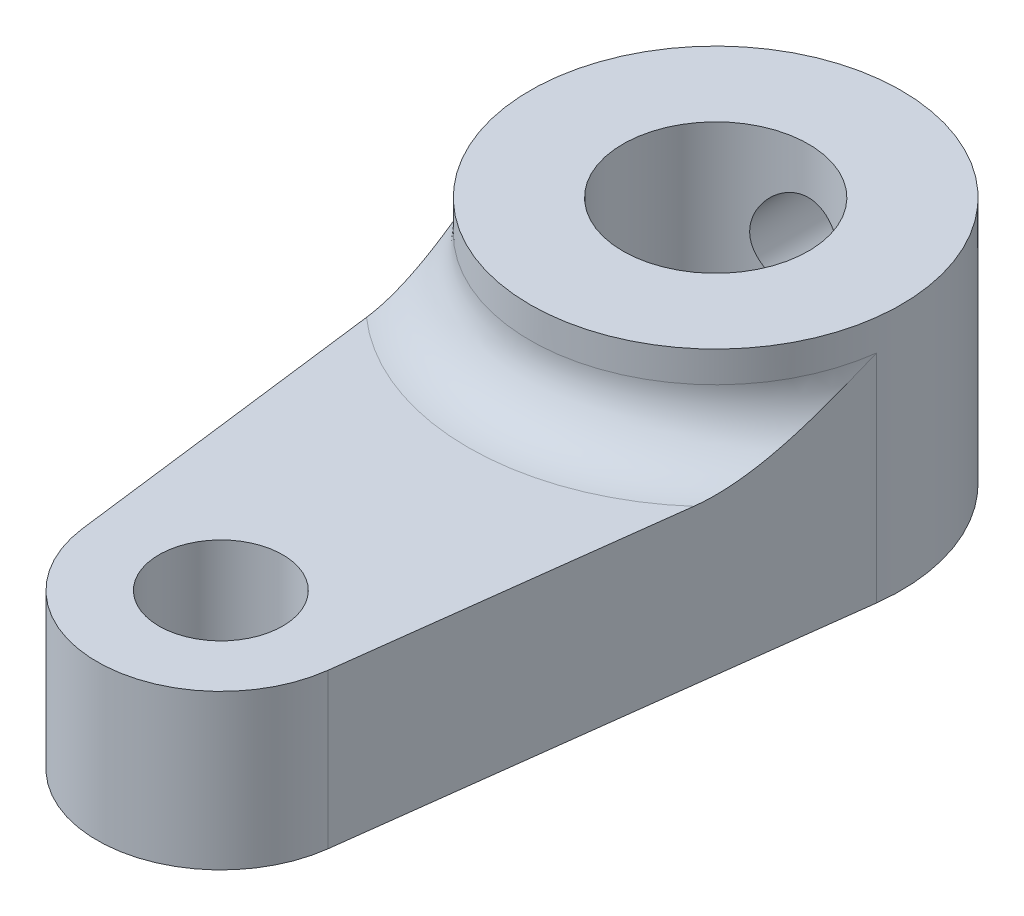
ISO-10303-21;
HEADER;
FILE_DESCRIPTION(('STEP AP214'),'2;1');
FILE_NAME('part.step','',(''),(''),'','','');
FILE_SCHEMA(('AUTOMOTIVE_DESIGN { 1 0 10303 214 1 1 1 1 }'));
ENDSEC;
DATA;
#1=APPLICATION_CONTEXT('core data for automotive mechanical design processes');
#2=APPLICATION_PROTOCOL_DEFINITION('international standard','automotive_design',2000,#1);
#3=PRODUCT_CONTEXT('',#1,'mechanical');
#4=PRODUCT('Part','Part','',(#3));
#5=PRODUCT_RELATED_PRODUCT_CATEGORY('part','',(#4));
#6=PRODUCT_DEFINITION_FORMATION('','',#4);
#7=PRODUCT_DEFINITION_CONTEXT('part definition',#1,'design');
#8=PRODUCT_DEFINITION('design','',#6,#7);
#9=PRODUCT_DEFINITION_SHAPE('','',#8);
#10=(LENGTH_UNIT() NAMED_UNIT(*) SI_UNIT(.MILLI.,.METRE.));
#11=(NAMED_UNIT(*) PLANE_ANGLE_UNIT() SI_UNIT($,.RADIAN.));
#12=(NAMED_UNIT(*) SI_UNIT($,.STERADIAN.) SOLID_ANGLE_UNIT());
#13=UNCERTAINTY_MEASURE_WITH_UNIT(LENGTH_MEASURE(1.E-05),#10,'distance_accuracy_value','');
#14=(GEOMETRIC_REPRESENTATION_CONTEXT(3) GLOBAL_UNCERTAINTY_ASSIGNED_CONTEXT((#13)) GLOBAL_UNIT_ASSIGNED_CONTEXT((#10,
#11,#12)) REPRESENTATION_CONTEXT('',''));
#15=CARTESIAN_POINT('',(0.,0.,0.));
#16=DIRECTION('',(0.,0.,1.));
#17=DIRECTION('',(1.,0.,0.));
#18=AXIS2_PLACEMENT_3D('',#15,#16,#17);
#19=CARTESIAN_POINT('',(-5.95294044989533,5.,0.750000000000001));
#20=DIRECTION('',(0.992156741649222,0.,-0.125));
#21=DIRECTION('',(-0.125,0.,-0.992156741649222));
#22=AXIS2_PLACEMENT_3D('',#19,#20,#21);
#23=PLANE('',#22);
#24=DIRECTION('',(0.125,0.,0.992156741649222));
#25=VECTOR('',#24,1.);
#26=CARTESIAN_POINT('',(-5.95294044989533,0.,0.750000000000001));
#27=LINE('',#26,#25);
#28=CARTESIAN_POINT('',(-5.95294044989533,0.,0.750000000000001));
#29=VERTEX_POINT('',#28);
#30=CARTESIAN_POINT('',(-3.96862696659688,0.,16.5));
#31=VERTEX_POINT('',#30);
#32=EDGE_CURVE('E168',#29,#31,#27,.T.);
#33=ORIENTED_EDGE('',*,*,#32,.T.);
#34=DIRECTION('',(0.,-1.,0.));
#35=VECTOR('',#34,1.);
#36=CARTESIAN_POINT('',(-3.96862696659688,5.,16.5));
#37=LINE('',#36,#35);
#38=CARTESIAN_POINT('',(-3.96862696659688,5.,16.5));
#39=VERTEX_POINT('',#38);
#40=EDGE_CURVE('E161',#39,#31,#37,.T.);
#41=ORIENTED_EDGE('',*,*,#40,.F.);
#42=DIRECTION('',(0.125,0.,0.992156741649222));
#43=VECTOR('',#42,1.);
#44=CARTESIAN_POINT('',(-5.95294044989533,5.,0.750000000000001));
#45=LINE('',#44,#43);
#46=CARTESIAN_POINT('',(-5.29150262212918,5.,6.00000000000001));
#47=VERTEX_POINT('',#46);
#48=EDGE_CURVE('E146',#47,#39,#45,.T.);
#49=ORIENTED_EDGE('',*,*,#48,.F.);
#50=CARTESIAN_POINT('',(-5.29150262212918,5.,6.));
#51=CARTESIAN_POINT('',(-5.31039781985104,5.00003932371851,5.85002401756371));
#52=CARTESIAN_POINT('',(-5.32927068108457,5.00749080861607,5.70022532550723));
#53=CARTESIAN_POINT('',(-5.3668298397168,5.03529748814452,5.40210874592607));
#54=CARTESIAN_POINT('',(-5.38551644968376,5.05562506504888,5.25378837746783));
#55=CARTESIAN_POINT('',(-5.42237695613113,5.10690972129888,4.96121717768887));
#56=CARTESIAN_POINT('',(-5.44055436264548,5.13771036698757,4.81693848633762));
#57=CARTESIAN_POINT('',(-5.47663555915596,5.20848018103613,4.53055286742049));
#58=CARTESIAN_POINT('',(-5.49453918362415,5.24845467894681,4.38844725369187));
#59=CARTESIAN_POINT('',(-5.55104862359349,5.38804779430905,3.93991747903271));
#60=CARTESIAN_POINT('',(-5.58909054596898,5.50228369716573,3.63796908103157));
#61=CARTESIAN_POINT('',(-5.66384180156036,5.75580816906752,3.04464938357773));
#62=CARTESIAN_POINT('',(-5.70054954085287,5.89512559194067,2.75329073549964));
#63=CARTESIAN_POINT('',(-5.80963672037306,6.33812108028194,1.88743809079183));
#64=CARTESIAN_POINT('',(-5.88048240155207,6.6653306727669,1.32511792920347));
#65=CARTESIAN_POINT('',(-5.95182241893323,6.99483605454595,0.758874095651361));
#66=CARTESIAN_POINT('',(-5.95238143594605,6.99741804396554,0.754437035667611));
#67=CARTESIAN_POINT('',(-5.95294044989533,7.,0.750000000000001));
#68=B_SPLINE_CURVE_WITH_KNOTS('',3,(#50,#51,#52,#53,#54,#55,#56,#57,#58,#59,#60,#61,#62,#63,#64,
#65,#66,#67),.UNSPECIFIED.,.F.,.F.,(4,2,2,2,2,2,2,2,4),(0.,0.453047985174652,0.905127510169083,
1.35073120961699,1.79659444088085,2.76988627914147,3.74430503334612,5.70583133706968,
5.72132327058451),.UNSPECIFIED.);
#69=CARTESIAN_POINT('',(-5.95294044989533,7.,0.750000000000001));
#70=VERTEX_POINT('',#69);
#71=EDGE_CURVE('E50',#47,#70,#68,.T.);
#72=ORIENTED_EDGE('',*,*,#71,.T.);
#73=DIRECTION('',(0.,-1.,0.));
#74=VECTOR('',#73,1.);
#75=CARTESIAN_POINT('',(-5.95294044989533,5.,0.750000000000001));
#76=LINE('',#75,#74);
#77=EDGE_CURVE('E337',#70,#29,#76,.T.);
#78=ORIENTED_EDGE('',*,*,#77,.T.);
#79=EDGE_LOOP('',(#33,#41,#49,#72,#78));
#80=FACE_BOUND('',#79,.T.);
#81=ADVANCED_FACE('F95',(#80),#23,.F.);
#82=CARTESIAN_POINT('',(0.,5.,16.));
#83=DIRECTION('',(0.,-1.,0.));
#84=DIRECTION('',(0.,0.,-1.));
#85=AXIS2_PLACEMENT_3D('',#82,#83,#84);
#86=CYLINDRICAL_SURFACE('',#85,4.);
#87=CARTESIAN_POINT('',(0.,0.,16.));
#88=DIRECTION('',(0.,1.,0.));
#89=DIRECTION('',(0.,0.,1.));
#90=AXIS2_PLACEMENT_3D('',#87,#88,#89);
#91=CIRCLE('',#90,4.);
#92=CARTESIAN_POINT('',(3.96862696659689,0.,16.5));
#93=VERTEX_POINT('',#92);
#94=EDGE_CURVE('E339',#31,#93,#91,.T.);
#95=ORIENTED_EDGE('',*,*,#94,.T.);
#96=DIRECTION('',(0.,-1.,0.));
#97=VECTOR('',#96,1.);
#98=CARTESIAN_POINT('',(3.96862696659689,5.,16.5));
#99=LINE('',#98,#97);
#100=CARTESIAN_POINT('',(3.96862696659689,5.,16.5));
#101=VERTEX_POINT('',#100);
#102=EDGE_CURVE('E163',#101,#93,#99,.T.);
#103=ORIENTED_EDGE('',*,*,#102,.F.);
#104=CARTESIAN_POINT('',(0.,5.,16.));
#105=DIRECTION('',(0.,1.,0.));
#106=DIRECTION('',(0.,0.,1.));
#107=AXIS2_PLACEMENT_3D('',#104,#105,#106);
#108=CIRCLE('',#107,4.);
#109=EDGE_CURVE('E150',#39,#101,#108,.T.);
#110=ORIENTED_EDGE('',*,*,#109,.F.);
#111=ORIENTED_EDGE('',*,*,#40,.T.);
#112=EDGE_LOOP('',(#95,#103,#110,#111));
#113=FACE_BOUND('',#112,.T.);
#114=ADVANCED_FACE('F160',(#113),#86,.T.);
#115=CARTESIAN_POINT('',(5.95294044989533,5.,0.75));
#116=DIRECTION('',(0.992156741649222,0.,0.125));
#117=DIRECTION('',(0.125,0.,-0.992156741649222));
#118=AXIS2_PLACEMENT_3D('',#115,#116,#117);
#119=PLANE('',#118);
#120=DIRECTION('',(-0.125,0.,0.992156741649222));
#121=VECTOR('',#120,1.);
#122=CARTESIAN_POINT('',(5.95294044989533,0.,0.75));
#123=LINE('',#122,#121);
#124=CARTESIAN_POINT('',(5.95294044989533,0.,0.749999999999999));
#125=VERTEX_POINT('',#124);
#126=EDGE_CURVE('E341',#125,#93,#123,.T.);
#127=ORIENTED_EDGE('',*,*,#126,.F.);
#128=DIRECTION('',(0.,-1.,0.));
#129=VECTOR('',#128,1.);
#130=CARTESIAN_POINT('',(5.95294044989533,5.,0.749999999999999));
#131=LINE('',#130,#129);
#132=CARTESIAN_POINT('',(5.95294044989533,7.,0.749999999999999));
#133=VERTEX_POINT('',#132);
#134=EDGE_CURVE('E173',#133,#125,#131,.T.);
#135=ORIENTED_EDGE('',*,*,#134,.F.);
#136=CARTESIAN_POINT('',(5.29150262212918,5.,6.));
#137=CARTESIAN_POINT('',(5.31039781985099,5.00003932371851,5.85002401756408));
#138=CARTESIAN_POINT('',(5.32927068108448,5.00749080861603,5.70022532550798));
#139=CARTESIAN_POINT('',(5.36682983971663,5.03529748814436,5.40210874592749));
#140=CARTESIAN_POINT('',(5.38551644968354,5.05562506504863,5.25378837746954));
#141=CARTESIAN_POINT('',(5.42237695613093,5.10690972129854,4.96121717769049));
#142=CARTESIAN_POINT('',(5.44055436264532,5.13771036698727,4.81693848633887));
#143=CARTESIAN_POINT('',(5.47663555915588,5.20848018103597,4.53055286742109));
#144=CARTESIAN_POINT('',(5.49453918362412,5.24845467894676,4.38844725369219));
#145=CARTESIAN_POINT('',(5.55104862359351,5.388047794309,3.93991747903255));
#146=CARTESIAN_POINT('',(5.58909054596904,5.50228369716535,3.6379690810311));
#147=CARTESIAN_POINT('',(5.6638418015604,5.75580816906824,3.0446493835774));
#148=CARTESIAN_POINT('',(5.70054954085285,5.89512559194285,2.75329073549978));
#149=CARTESIAN_POINT('',(5.80963672037343,6.33812108027884,1.88743809078903));
#150=CARTESIAN_POINT('',(5.88048240155358,6.66533067274761,1.32511792919187));
#151=CARTESIAN_POINT('',(5.95182241893326,6.99483605454567,0.75887409565114));
#152=CARTESIAN_POINT('',(5.95238143594606,6.9974180439654,0.7544370356675));
#153=CARTESIAN_POINT('',(5.95294044989533,7.,0.75));
#154=B_SPLINE_CURVE_WITH_KNOTS('',3,(#136,#137,#138,#139,#140,#141,#142,#143,#144,#145,#146,
#147,#148,#149,#150,#151,#152,#153),.UNSPECIFIED.,.F.,.F.,(4,2,2,2,2,2,2,2,4),(0.,
0.453047985173508,0.905127510167047,1.35073120961605,1.79659444088085,2.7698862791418,
3.74430503334741,5.70583133706976,5.72132327058452),.UNSPECIFIED.);
#155=CARTESIAN_POINT('',(5.29150262212918,5.,6.));
#156=VERTEX_POINT('',#155);
#157=EDGE_CURVE('E110',#133,#156,#154,.F.);
#158=ORIENTED_EDGE('',*,*,#157,.T.);
#159=DIRECTION('',(-0.125,0.,0.992156741649222));
#160=VECTOR('',#159,1.);
#161=CARTESIAN_POINT('',(5.95294044989533,5.,0.75));
#162=LINE('',#161,#160);
#163=EDGE_CURVE('E164',#156,#101,#162,.T.);
#164=ORIENTED_EDGE('',*,*,#163,.T.);
#165=ORIENTED_EDGE('',*,*,#102,.T.);
#166=EDGE_LOOP('',(#127,#135,#158,#164,#165));
#167=FACE_BOUND('',#166,.T.);
#168=ADVANCED_FACE('F187',(#167),#119,.T.);
#169=CARTESIAN_POINT('',(0.,5.,0.));
#170=DIRECTION('',(0.,-1.,0.));
#171=DIRECTION('',(0.,0.,-1.));
#172=AXIS2_PLACEMENT_3D('',#169,#170,#171);
#173=CYLINDRICAL_SURFACE('',#172,6.);
#174=CARTESIAN_POINT('',(0.,6.5,-6.));
#175=CARTESIAN_POINT('',(-0.082876088669731,6.49999767426184,-5.99999859868013));
#176=CARTESIAN_POINT('',(-0.165778157830763,6.49310844922621,-5.99826578131828));
#177=CARTESIAN_POINT('',(-0.329206323770532,6.46577484869299,-5.99152113829892));
#178=CARTESIAN_POINT('',(-0.409731046870739,6.44532279046215,-5.98650745419968));
#179=CARTESIAN_POINT('',(-0.566020872182576,6.39156074653791,-5.9737562633204));
#180=CARTESIAN_POINT('',(-0.641791563430002,6.35826620128472,-5.96602202842087));
#181=CARTESIAN_POINT('',(-0.786672131904425,6.27981860995517,-5.94865343807593));
#182=CARTESIAN_POINT('',(-0.855781784348758,6.23466516388106,-5.9390190185405));
#183=CARTESIAN_POINT('',(-0.986801927300918,6.13279921034579,-5.91867413591801));
#184=CARTESIAN_POINT('',(-1.04855569006107,6.07588842504082,-5.90794707148533));
#185=CARTESIAN_POINT('',(-1.1617489272033,5.95254779509108,-5.8867362011753));
#186=CARTESIAN_POINT('',(-1.21318723694913,5.8861168770535,-5.87625242288349));
#187=CARTESIAN_POINT('',(-1.30502654279903,5.74440477326256,-5.8565477569971));
#188=CARTESIAN_POINT('',(-1.34525221592536,5.6690067691896,-5.84734794470605));
#189=CARTESIAN_POINT('',(-1.41239690855053,5.51225158834164,-5.83149494812223));
#190=CARTESIAN_POINT('',(-1.43931805543933,5.43089536667424,-5.82484135672789));
#191=CARTESIAN_POINT('',(-1.47855483680429,5.26625650179752,-5.81500476717551));
#192=CARTESIAN_POINT('',(-1.49115226833334,5.1830451039502,-5.81175491075426));
#193=CARTESIAN_POINT('',(-1.50226177506785,5.01563143098602,-5.80889362537741));
#194=CARTESIAN_POINT('',(-1.50077614181798,4.93142931930139,-5.80928160448644));
#195=CARTESIAN_POINT('',(-1.48398652463928,4.76658419225552,-5.81359205496618));
#196=CARTESIAN_POINT('',(-1.46901834019052,4.6859043785349,-5.81742863001879));
#197=CARTESIAN_POINT('',(-1.4262241869031,4.52823894908871,-5.82806709676484));
#198=CARTESIAN_POINT('',(-1.39839730206942,4.45125359697102,-5.83486919970697));
#199=CARTESIAN_POINT('',(-1.33038947793715,4.30226198374793,-5.85075113904187));
#200=CARTESIAN_POINT('',(-1.29008666723291,4.23031382821045,-5.85985327469421));
#201=CARTESIAN_POINT('',(-1.19835627601495,4.09408129024316,-5.87929710846386));
#202=CARTESIAN_POINT('',(-1.14692674880884,4.02979825193274,-5.88963902334735));
#203=CARTESIAN_POINT('',(-1.03266342468122,3.9087963843056,-5.91075880539781));
#204=CARTESIAN_POINT('',(-0.969546258165858,3.85234550993865,-5.92154069477971));
#205=CARTESIAN_POINT('',(-0.834611917503699,3.7507787575361,-5.94205965578786));
#206=CARTESIAN_POINT('',(-0.762794477707943,3.70566322573644,-5.95179669549415));
#207=CARTESIAN_POINT('',(-0.612115888681391,3.62794941377562,-5.96917732094183));
#208=CARTESIAN_POINT('',(-0.533231393208623,3.59539465974557,-5.97681360127725));
#209=CARTESIAN_POINT('',(-0.370876008142882,3.54408269429043,-5.98907916991419));
#210=CARTESIAN_POINT('',(-0.287405999150484,3.52532284358186,-5.99370903339281));
#211=CARTESIAN_POINT('',(-0.120539970390027,3.50254243444116,-5.99935499271375));
#212=CARTESIAN_POINT('',(-0.0371967199882097,3.4981569739247,-6.00046053508279));
#213=CARTESIAN_POINT('',(0.129032874801508,3.50324900205549,-5.99918804814451));
#214=CARTESIAN_POINT('',(0.211919259644595,3.51272524279913,-5.99681033241847));
#215=CARTESIAN_POINT('',(0.373614268776491,3.54497090839138,-5.98889581127357));
#216=CARTESIAN_POINT('',(0.452465118968754,3.56754126347699,-5.98340634185811));
#217=CARTESIAN_POINT('',(0.605257292452511,3.62510708402845,-5.96988706634134));
#218=CARTESIAN_POINT('',(0.679198119032634,3.66010380431317,-5.96185700369892));
#219=CARTESIAN_POINT('',(0.821523134429846,3.74223612887473,-5.9439330792631));
#220=CARTESIAN_POINT('',(0.889785441835829,3.78957611239676,-5.93400867366932));
#221=CARTESIAN_POINT('',(1.01752661364324,3.89478990879697,-5.91344509187419));
#222=CARTESIAN_POINT('',(1.07700395897301,3.95266553961691,-5.90280579251705));
#223=CARTESIAN_POINT('',(1.18699056807273,4.07900196084447,-5.88168956960771));
#224=CARTESIAN_POINT('',(1.23724386762203,4.14768770300242,-5.87122304187281));
#225=CARTESIAN_POINT('',(1.3255107590127,4.29273263446572,-5.85192878377239));
#226=CARTESIAN_POINT('',(1.36352489415793,4.36909148295975,-5.84310098067026));
#227=CARTESIAN_POINT('',(1.42595142060929,4.52690572241308,-5.82818094734665));
#228=CARTESIAN_POINT('',(1.45044439665406,4.60832762834401,-5.82207255291906));
#229=CARTESIAN_POINT('',(1.48534565995378,4.77430963788911,-5.81326744090184));
#230=CARTESIAN_POINT('',(1.49575702747866,4.85886905103249,-5.81056997719936));
#231=CARTESIAN_POINT('',(1.50203859033399,5.0261210238552,-5.80894901203957));
#232=CARTESIAN_POINT('',(1.49831789778012,5.10879743512473,-5.80991932728264));
#233=CARTESIAN_POINT('',(1.47737727831287,5.27230388866798,-5.81527909007843));
#234=CARTESIAN_POINT('',(1.46015762268677,5.35313396801365,-5.81966846891857));
#235=CARTESIAN_POINT('',(1.41293131944279,5.51020845906541,-5.83131260682722));
#236=CARTESIAN_POINT('',(1.38300140468037,5.58647730524021,-5.83855015236309));
#237=CARTESIAN_POINT('',(1.31126491360507,5.73296538271369,-5.85507755724829));
#238=CARTESIAN_POINT('',(1.26945669003419,5.80318377318691,-5.86436770120773));
#239=CARTESIAN_POINT('',(1.17386774863714,5.93755462900202,-5.88425634263512));
#240=CARTESIAN_POINT('',(1.11980316291225,6.00150107342396,-5.89488264831757));
#241=CARTESIAN_POINT('',(1.00178937118973,6.11954704479541,-5.91608027246286));
#242=CARTESIAN_POINT('',(0.937837821261145,6.17364423011297,-5.9266515772706));
#243=CARTESIAN_POINT('',(0.80046758670259,6.27141130856461,-5.94677655647663));
#244=CARTESIAN_POINT('',(0.726898422316386,6.31487461367158,-5.95630833365868));
#245=CARTESIAN_POINT('',(0.573266059510476,6.38874746294053,-5.97304924975118));
#246=CARTESIAN_POINT('',(0.493207563436739,6.41916636064853,-5.98026005199781));
#247=CARTESIAN_POINT('',(0.344410253243472,6.46157183032965,-5.99048059565542));
#248=CARTESIAN_POINT('',(0.276380170908069,6.47595124305343,-5.99402585052691));
#249=CARTESIAN_POINT('',(0.138906071536283,6.49516594362194,-5.99878605231948));
#250=CARTESIAN_POINT('',(0.0694621612426163,6.5000019493053,-6.00000117450894));
#251=CARTESIAN_POINT('',(0.,6.5,-6.));
#252=B_SPLINE_CURVE_WITH_KNOTS('',3,(#174,#175,#176,#177,#178,#179,#180,#181,#182,#183,#184,
#185,#186,#187,#188,#189,#190,#191,#192,#193,#194,#195,#196,#197,#198,#199,#200,#201,#202,#203,
#204,#205,#206,#207,#208,#209,#210,#211,#212,#213,#214,#215,#216,#217,#218,#219,#220,#221,#222,
#223,#224,#225,#226,#227,#228,#229,#230,#231,#232,#233,#234,#235,#236,#237,#238,#239,#240,#241,
#242,#243,#244,#245,#246,#247,#248,#249,#250,#251),.UNSPECIFIED.,.T.,.F.,(4,2,2,2,2,2,2,2,2,2,2,
2,2,2,2,2,2,2,2,2,2,2,2,2,2,2,2,2,2,2,2,2,2,2,2,2,2,2,4),(0.,0.248373712471889,
0.496888237763899,0.745104902286104,0.993329940169327,1.24614435437139,1.49898729580062,
1.75558647545807,2.01214461169368,2.2635629509943,2.51494038112697,2.76022497007018,
3.00552703466038,3.25330527873879,3.50112690836162,3.75601500969019,4.01091089558247,
4.26668229009114,4.52240473688642,4.77158308949276,5.02073901112742,5.26620274514037,
5.5116912732229,5.76153587565351,6.01142363008018,6.26744509204475,6.52345518749507,
6.77792254614035,7.03233423252407,7.27943780398612,7.52653640956033,7.77216400559446,
8.017825681369,8.26989576409909,8.52202569770417,8.77872185499587,9.03523363821349,
9.24342242942148,9.45159556043038),.UNSPECIFIED.);
#253=CARTESIAN_POINT('',(0.,6.5,-6.));
#254=VERTEX_POINT('',#253);
#255=EDGE_CURVE('E100',#254,#254,#252,.T.);
#256=ORIENTED_EDGE('',*,*,#255,.T.);
#257=EDGE_LOOP('',(#256));
#258=FACE_BOUND('',#257,.T.);
#259=CARTESIAN_POINT('',(0.,7.,0.));
#260=DIRECTION('',(0.,1.,0.));
#261=DIRECTION('',(0.,0.,1.));
#262=AXIS2_PLACEMENT_3D('',#259,#260,#261);
#263=CIRCLE('',#262,6.);
#264=EDGE_CURVE('E169',#70,#133,#263,.T.);
#265=ORIENTED_EDGE('',*,*,#264,.T.);
#266=ORIENTED_EDGE('',*,*,#134,.T.);
#267=CARTESIAN_POINT('',(0.,0.,0.));
#268=DIRECTION('',(0.,1.,0.));
#269=DIRECTION('',(0.,0.,1.));
#270=AXIS2_PLACEMENT_3D('',#267,#268,#269);
#271=CIRCLE('',#270,6.);
#272=EDGE_CURVE('E344',#125,#29,#271,.T.);
#273=ORIENTED_EDGE('',*,*,#272,.T.);
#274=ORIENTED_EDGE('',*,*,#77,.F.);
#275=EDGE_LOOP('',(#265,#266,#273,#274));
#276=FACE_BOUND('',#275,.T.);
#277=CARTESIAN_POINT('',(0.,8.,0.));
#278=DIRECTION('',(0.,1.,0.));
#279=DIRECTION('',(0.,0.,1.));
#280=AXIS2_PLACEMENT_3D('',#277,#278,#279);
#281=CIRCLE('',#280,6.);
#282=CARTESIAN_POINT('',(0.,8.,6.));
#283=VERTEX_POINT('',#282);
#284=EDGE_CURVE('E328',#283,#283,#281,.T.);
#285=ORIENTED_EDGE('',*,*,#284,.F.);
#286=EDGE_LOOP('',(#285));
#287=FACE_BOUND('',#286,.T.);
#288=ADVANCED_FACE('F191',(#258,#276,#287),#173,.T.);
#289=CARTESIAN_POINT('',(0.,5.,16.));
#290=DIRECTION('',(0.,-1.,0.));
#291=DIRECTION('',(0.,0.,-1.));
#292=AXIS2_PLACEMENT_3D('',#289,#290,#291);
#293=CYLINDRICAL_SURFACE('',#292,2.);
#294=CARTESIAN_POINT('',(0.,5.,16.));
#295=DIRECTION('',(0.,1.,0.));
#296=DIRECTION('',(0.,0.,1.));
#297=AXIS2_PLACEMENT_3D('',#294,#295,#296);
#298=CIRCLE('',#297,2.);
#299=CARTESIAN_POINT('',(0.,5.,18.));
#300=VERTEX_POINT('',#299);
#301=EDGE_CURVE('E334',#300,#300,#298,.T.);
#302=ORIENTED_EDGE('',*,*,#301,.T.);
#303=EDGE_LOOP('',(#302));
#304=FACE_BOUND('',#303,.T.);
#305=CARTESIAN_POINT('',(0.,0.,16.));
#306=DIRECTION('',(0.,1.,0.));
#307=DIRECTION('',(0.,0.,1.));
#308=AXIS2_PLACEMENT_3D('',#305,#306,#307);
#309=CIRCLE('',#308,2.);
#310=CARTESIAN_POINT('',(0.,0.,18.));
#311=VERTEX_POINT('',#310);
#312=EDGE_CURVE('E155',#311,#311,#309,.T.);
#313=ORIENTED_EDGE('',*,*,#312,.F.);
#314=EDGE_LOOP('',(#313));
#315=FACE_BOUND('',#314,.T.);
#316=ADVANCED_FACE('F215',(#304,#315),#293,.F.);
#317=CARTESIAN_POINT('',(0.,5.,0.));
#318=DIRECTION('',(0.,1.,0.));
#319=DIRECTION('',(0.,0.,1.));
#320=AXIS2_PLACEMENT_3D('',#317,#318,#319);
#321=PLANE('',#320);
#322=ORIENTED_EDGE('',*,*,#163,.F.);
#323=CARTESIAN_POINT('',(0.,5.,0.));
#324=DIRECTION('',(0.,1.,0.));
#325=DIRECTION('',(0.,0.,1.));
#326=AXIS2_PLACEMENT_3D('',#323,#324,#325);
#327=CIRCLE('',#326,8.);
#328=EDGE_CURVE('E123',#156,#47,#327,.F.);
#329=ORIENTED_EDGE('',*,*,#328,.T.);
#330=ORIENTED_EDGE('',*,*,#48,.T.);
#331=ORIENTED_EDGE('',*,*,#109,.T.);
#332=EDGE_LOOP('',(#322,#329,#330,#331));
#333=FACE_BOUND('',#332,.T.);
#334=ORIENTED_EDGE('',*,*,#301,.F.);
#335=EDGE_LOOP('',(#334));
#336=FACE_BOUND('',#335,.T.);
#337=ADVANCED_FACE('F148',(#333,#336),#321,.T.);
#338=CARTESIAN_POINT('',(0.,0.,0.));
#339=DIRECTION('',(0.,1.,0.));
#340=DIRECTION('',(0.,0.,1.));
#341=AXIS2_PLACEMENT_3D('',#338,#339,#340);
#342=PLANE('',#341);
#343=CARTESIAN_POINT('',(0.,0.,0.));
#344=DIRECTION('',(0.,1.,0.));
#345=DIRECTION('',(0.,0.,1.));
#346=AXIS2_PLACEMENT_3D('',#343,#344,#345);
#347=CIRCLE('',#346,3.);
#348=CARTESIAN_POINT('',(0.,0.,3.));
#349=VERTEX_POINT('',#348);
#350=EDGE_CURVE('E325',#349,#349,#347,.T.);
#351=ORIENTED_EDGE('',*,*,#350,.T.);
#352=EDGE_LOOP('',(#351));
#353=FACE_BOUND('',#352,.T.);
#354=ORIENTED_EDGE('',*,*,#32,.F.);
#355=ORIENTED_EDGE('',*,*,#272,.F.);
#356=ORIENTED_EDGE('',*,*,#126,.T.);
#357=ORIENTED_EDGE('',*,*,#94,.F.);
#358=EDGE_LOOP('',(#354,#355,#356,#357));
#359=FACE_BOUND('',#358,.T.);
#360=ORIENTED_EDGE('',*,*,#312,.T.);
#361=EDGE_LOOP('',(#360));
#362=FACE_BOUND('',#361,.T.);
#363=ADVANCED_FACE('F228',(#353,#359,#362),#342,.F.);
#364=CARTESIAN_POINT('',(0.,8.,0.));
#365=DIRECTION('',(0.,1.,0.));
#366=DIRECTION('',(0.,0.,1.));
#367=AXIS2_PLACEMENT_3D('',#364,#365,#366);
#368=PLANE('',#367);
#369=CARTESIAN_POINT('',(0.,8.,0.));
#370=DIRECTION('',(0.,1.,0.));
#371=DIRECTION('',(0.,0.,1.));
#372=AXIS2_PLACEMENT_3D('',#369,#370,#371);
#373=CIRCLE('',#372,3.);
#374=CARTESIAN_POINT('',(0.,8.,3.));
#375=VERTEX_POINT('',#374);
#376=EDGE_CURVE('E324',#375,#375,#373,.T.);
#377=ORIENTED_EDGE('',*,*,#376,.F.);
#378=EDGE_LOOP('',(#377));
#379=FACE_BOUND('',#378,.T.);
#380=ORIENTED_EDGE('',*,*,#284,.T.);
#381=EDGE_LOOP('',(#380));
#382=FACE_BOUND('',#381,.T.);
#383=ADVANCED_FACE('F236',(#379,#382),#368,.T.);
#384=CARTESIAN_POINT('',(0.,7.,0.));
#385=DIRECTION('',(0.,1.,0.));
#386=DIRECTION('',(0.,0.,1.));
#387=AXIS2_PLACEMENT_3D('',#384,#385,#386);
#388=TOROIDAL_SURFACE('',#387,8.,2.);
#389=ORIENTED_EDGE('',*,*,#71,.F.);
#390=ORIENTED_EDGE('',*,*,#328,.F.);
#391=ORIENTED_EDGE('',*,*,#157,.F.);
#392=ORIENTED_EDGE('',*,*,#264,.F.);
#393=EDGE_LOOP('',(#389,#390,#391,#392));
#394=FACE_BOUND('',#393,.T.);
#395=ADVANCED_FACE('F97',(#394),#388,.F.);
#396=CARTESIAN_POINT('',(0.,0.,0.));
#397=DIRECTION('',(0.,1.,0.));
#398=DIRECTION('',(0.,0.,1.));
#399=AXIS2_PLACEMENT_3D('',#396,#397,#398);
#400=CYLINDRICAL_SURFACE('',#399,3.);
#401=CARTESIAN_POINT('',(-1.5,5.,-2.59807621135332));
#402=CARTESIAN_POINT('',(-1.4999945446118,5.07816171229288,-2.59808302092689));
#403=CARTESIAN_POINT('',(-1.49384995609982,5.15642211728757,-2.60165701781635));
#404=CARTESIAN_POINT('',(-1.46958481484708,5.31054089701573,-2.61543549678079));
#405=CARTESIAN_POINT('',(-1.45143909683127,5.38639387256511,-2.62565391083339));
#406=CARTESIAN_POINT('',(-1.40414992304972,5.53317749651591,-2.65124019908098));
#407=CARTESIAN_POINT('',(-1.37506492874059,5.60413197871038,-2.66658065209878));
#408=CARTESIAN_POINT('',(-1.30690128806456,5.74013630299508,-2.70063997225287));
#409=CARTESIAN_POINT('',(-1.26782210105366,5.80518582539369,-2.71935902214097));
#410=CARTESIAN_POINT('',(-1.17699981079632,5.93345859283626,-2.75995303586162));
#411=CARTESIAN_POINT('',(-1.12447805421565,5.99608870351031,-2.7819609545693));
#412=CARTESIAN_POINT('',(-1.0098807114217,6.11211258261006,-2.82557974178559));
#413=CARTESIAN_POINT('',(-0.947800388673438,6.16550174387528,-2.84719040746875));
#414=CARTESIAN_POINT('',(-0.810734345121818,6.26505072672149,-2.88932215429424));
#415=CARTESIAN_POINT('',(-0.735160783518861,6.31048065178929,-2.90967159627259));
#416=CARTESIAN_POINT('',(-0.576235539899255,6.38771127986864,-2.94526134149294));
#417=CARTESIAN_POINT('',(-0.492888807207232,6.41952058420575,-2.96050486775612));
#418=CARTESIAN_POINT('',(-0.327067415888965,6.46625699195164,-2.98320691866356));
#419=CARTESIAN_POINT('',(-0.244952685733225,6.4822242895333,-2.99114220331338));
#420=CARTESIAN_POINT('',(-0.0788559430467717,6.50024917801256,-3.00011375769101));
#421=CARTESIAN_POINT('',(0.00512490876560808,6.50231518519356,-3.00115420176885));
#422=CARTESIAN_POINT('',(0.164748786635625,6.49287998904447,-2.99644472874675));
#423=CARTESIAN_POINT('',(0.240481798765187,6.48254297671816,-2.99127743838241));
#424=CARTESIAN_POINT('',(0.388970657877483,6.45067873414301,-2.97561367889621));
#425=CARTESIAN_POINT('',(0.461726281640888,6.42915066653566,-2.96511681099591));
#426=CARTESIAN_POINT('',(0.60346408735433,6.37537615086528,-2.93957374931482));
#427=CARTESIAN_POINT('',(0.672380135272768,6.3429855302419,-2.92446662293799));
#428=CARTESIAN_POINT('',(0.803965202269992,6.26860487569776,-2.89106468980031));
#429=CARTESIAN_POINT('',(0.866631973257968,6.22661140504647,-2.87276874236226));
#430=CARTESIAN_POINT('',(0.990260491347292,6.12965697270048,-2.83266591598844));
#431=CARTESIAN_POINT('',(1.05050111254404,6.07384545751098,-2.81069063997263));
#432=CARTESIAN_POINT('',(1.16115655544667,5.95311541260473,-2.76681510880218));
#433=CARTESIAN_POINT('',(1.21156381736135,5.8881899415889,-2.74491492398443));
#434=CARTESIAN_POINT('',(1.30425800196332,5.74602771136387,-2.70216234138727));
#435=CARTESIAN_POINT('',(1.34582597246708,5.66827096541868,-2.68146479986061));
#436=CARTESIAN_POINT('',(1.41497866950185,5.5055934929615,-2.64563175417864));
#437=CARTESIAN_POINT('',(1.44257798731633,5.42068035047366,-2.63049045069101));
#438=CARTESIAN_POINT('',(1.48077031653756,5.25317823307581,-2.60916953725552));
#439=CARTESIAN_POINT('',(1.49253768317996,5.17093832143467,-2.60237483772745));
#440=CARTESIAN_POINT('',(1.50227541991714,5.00539798772519,-2.59676879042414));
#441=CARTESIAN_POINT('',(1.50025553597254,4.92209835632032,-2.59795180333967));
#442=CARTESIAN_POINT('',(1.48355406501595,4.76651912213191,-2.60751504810877));
#443=CARTESIAN_POINT('',(1.4702817250687,4.69403082333811,-2.61509381259981));
#444=CARTESIAN_POINT('',(1.43354442694866,4.55244832059356,-2.63541032327012));
#445=CARTESIAN_POINT('',(1.41007616793542,4.48335522388009,-2.64814974007551));
#446=CARTESIAN_POINT('',(1.35247138290733,4.34688300364596,-2.67804333119485));
#447=CARTESIAN_POINT('',(1.31789109553908,4.27973147471967,-2.69537464864595));
#448=CARTESIAN_POINT('',(1.2394305960237,4.15179609269151,-2.73234179245875));
#449=CARTESIAN_POINT('',(1.19554560649832,4.09101553473007,-2.75197880032721));
#450=CARTESIAN_POINT('',(1.09325575079828,3.96953184871468,-2.79431997684504));
#451=CARTESIAN_POINT('',(1.03371790847245,3.90980427392351,-2.81709874731434));
#452=CARTESIAN_POINT('',(0.905106743097431,3.80088164300961,-2.86101352466839));
#453=CARTESIAN_POINT('',(0.836030211983019,3.75169014465419,-2.88214897511564));
#454=CARTESIAN_POINT('',(0.687803043838134,3.66413941107485,-2.92112042536435));
#455=CARTESIAN_POINT('',(0.608434646361169,3.62610032268364,-2.93885462508044));
#456=CARTESIAN_POINT('',(0.443283546961622,3.56429314421391,-2.96825032438952));
#457=CARTESIAN_POINT('',(0.357506552088263,3.54051252295054,-2.9799171551456));
#458=CARTESIAN_POINT('',(0.190469523495625,3.50994715373801,-2.99501262272824));
#459=CARTESIAN_POINT('',(0.109517165775684,3.50180318618583,-2.99909891862287));
#460=CARTESIAN_POINT('',(-0.0526889789268062,3.4987351018184,-3.00063195562697));
#461=CARTESIAN_POINT('',(-0.133942650442631,3.50380635721466,-2.99808102100335));
#462=CARTESIAN_POINT('',(-0.288806988475721,3.52612461019344,-2.98700953256884));
#463=CARTESIAN_POINT('',(-0.362568476716896,3.54254727388651,-2.97889342001985));
#464=CARTESIAN_POINT('',(-0.506168928275426,3.58599049895446,-2.95788140495135));
#465=CARTESIAN_POINT('',(-0.576007327433263,3.61301258014018,-2.94498481699194));
#466=CARTESIAN_POINT('',(-0.713135109367327,3.67809057824896,-2.9148889612218));
#467=CARTESIAN_POINT('',(-0.780187714050069,3.71656898481176,-2.89752925798199));
#468=CARTESIAN_POINT('',(-0.907161962721036,3.80293689628858,-2.86032199712739));
#469=CARTESIAN_POINT('',(-0.96708031112236,3.85083072367351,-2.84047329837541));
#470=CARTESIAN_POINT('',(-1.08437100623534,3.96019570853406,-2.79792915339941));
#471=CARTESIAN_POINT('',(-1.14089652680891,4.02254373121579,-2.77514698517547));
#472=CARTESIAN_POINT('',(-1.24299493109201,4.15617608169466,-2.73094614244279));
#473=CARTESIAN_POINT('',(-1.28855812501509,4.22746823130153,-2.70952868642798));
#474=CARTESIAN_POINT('',(-1.36864661967848,4.37995496987144,-2.66999407957374));
#475=CARTESIAN_POINT('',(-1.40277759894141,4.46139129669311,-2.65200261384405));
#476=CARTESIAN_POINT('',(-1.45631806425962,4.62999860650967,-2.62299234492527));
#477=CARTESIAN_POINT('',(-1.47577678676302,4.71714933336903,-2.61195024221553));
#478=CARTESIAN_POINT('',(-1.49155051179662,4.837708033478,-2.60293908902686));
#479=CARTESIAN_POINT('',(-1.49471415744577,4.87005184159683,-2.60112193507728));
#480=CARTESIAN_POINT('',(-1.49894010763494,4.93492472102337,-2.59868903831625));
#481=CARTESIAN_POINT('',(-1.5000022715998,4.96745380457881,-2.59807337587664));
#482=CARTESIAN_POINT('',(-1.5,5.,-2.59807621135332));
#483=B_SPLINE_CURVE_WITH_KNOTS('',3,(#401,#402,#403,#404,#405,#406,#407,#408,#409,#410,#411,
#412,#413,#414,#415,#416,#417,#418,#419,#420,#421,#422,#423,#424,#425,#426,#427,#428,#429,#430,
#431,#432,#433,#434,#435,#436,#437,#438,#439,#440,#441,#442,#443,#444,#445,#446,#447,#448,#449,
#450,#451,#452,#453,#454,#455,#456,#457,#458,#459,#460,#461,#462,#463,#464,#465,#466,#467,#468,
#469,#470,#471,#472,#473,#474,#475,#476,#477,#478,#479,#480,#481,#482),.UNSPECIFIED.,.T.,.F.,(4,
2,2,2,2,2,2,2,2,2,2,2,2,2,2,2,2,2,2,2,2,2,2,2,2,2,2,2,2,2,2,2,2,2,2,2,2,2,2,2,4),(0.,
0.234348183892072,0.469189339237207,0.702792893878328,0.936409088167724,1.18929346874735,
1.44230356626556,1.71236838358145,1.98226240445836,2.23295227451903,2.4834903552906,
2.71224146226807,2.94100968776182,3.1729430209672,3.40495949025407,3.65890787185336,
3.91305072368878,4.18333262594172,4.45333161317557,4.70193436281317,4.95036139782559,
5.17161275136038,5.39293578654094,5.62450944609131,5.8562022933007,6.11710115370919,
6.37808797467303,6.64596272119448,6.91360169713157,7.15668405584229,7.39968130190957,
7.62666637307238,7.85368400268019,8.09041126079207,8.32724745151078,8.587653627751,
8.8482891426773,9.11716123557906,9.38512699504139,9.48270202777963,9.5802835874181),.UNSPECIFIED.);
#484=CARTESIAN_POINT('',(-1.5,5.,-2.59807621135332));
#485=VERTEX_POINT('',#484);
#486=EDGE_CURVE('E318',#485,#485,#483,.T.);
#487=ORIENTED_EDGE('',*,*,#486,.T.);
#488=EDGE_LOOP('',(#487));
#489=FACE_BOUND('',#488,.T.);
#490=ORIENTED_EDGE('',*,*,#350,.F.);
#491=EDGE_LOOP('',(#490));
#492=FACE_BOUND('',#491,.T.);
#493=ORIENTED_EDGE('',*,*,#376,.T.);
#494=EDGE_LOOP('',(#493));
#495=FACE_BOUND('',#494,.T.);
#496=ADVANCED_FACE('F249',(#489,#492,#495),#400,.F.);
#497=CARTESIAN_POINT('',(0.,5.,-8.1903036601085));
#498=DIRECTION('',(0.,0.,-1.));
#499=DIRECTION('',(-1.,0.,0.));
#500=AXIS2_PLACEMENT_3D('',#497,#498,#499);
#501=CYLINDRICAL_SURFACE('',#500,1.5);
#502=ORIENTED_EDGE('',*,*,#255,.F.);
#503=EDGE_LOOP('',(#502));
#504=FACE_BOUND('',#503,.T.);
#505=ORIENTED_EDGE('',*,*,#486,.F.);
#506=EDGE_LOOP('',(#505));
#507=FACE_BOUND('',#506,.T.);
#508=ADVANCED_FACE('F255',(#504,#507),#501,.F.);
#509=CLOSED_SHELL('',(#81,#114,#168,#288,#316,#337,#363,#383,#395,#496,#508));
#510=MANIFOLD_SOLID_BREP('B6',#509);
#511=ADVANCED_BREP_SHAPE_REPRESENTATION('',(#18,#510),#14);
#512=SHAPE_DEFINITION_REPRESENTATION(#9,#511);
ENDSEC;
END-ISO-10303-21;
